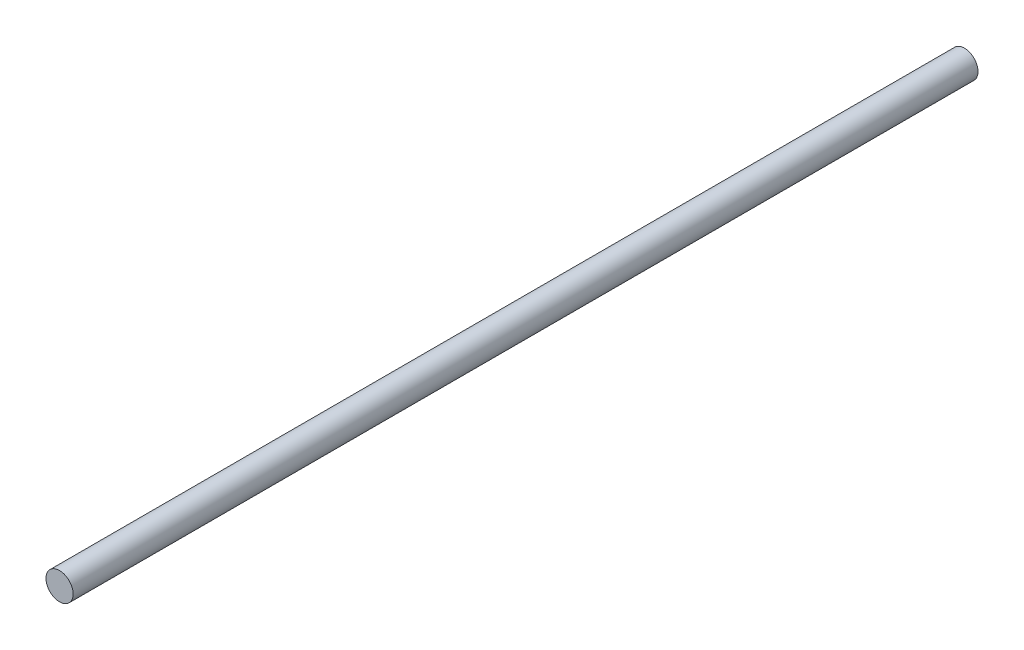
ISO-10303-21;
HEADER;
FILE_DESCRIPTION(('STEP AP214'),'2;1');
FILE_NAME('part.step','',(''),(''),'','','');
FILE_SCHEMA(('AUTOMOTIVE_DESIGN { 1 0 10303 214 1 1 1 1 }'));
ENDSEC;
DATA;
#1=APPLICATION_CONTEXT('core data for automotive mechanical design processes');
#2=APPLICATION_PROTOCOL_DEFINITION('international standard','automotive_design',2000,#1);
#3=PRODUCT_CONTEXT('',#1,'mechanical');
#4=PRODUCT('Part','Part','',(#3));
#5=PRODUCT_RELATED_PRODUCT_CATEGORY('part','',(#4));
#6=PRODUCT_DEFINITION_FORMATION('','',#4);
#7=PRODUCT_DEFINITION_CONTEXT('part definition',#1,'design');
#8=PRODUCT_DEFINITION('design','',#6,#7);
#9=PRODUCT_DEFINITION_SHAPE('','',#8);
#10=(LENGTH_UNIT() NAMED_UNIT(*) SI_UNIT(.MILLI.,.METRE.));
#11=(NAMED_UNIT(*) PLANE_ANGLE_UNIT() SI_UNIT($,.RADIAN.));
#12=(NAMED_UNIT(*) SI_UNIT($,.STERADIAN.) SOLID_ANGLE_UNIT());
#13=UNCERTAINTY_MEASURE_WITH_UNIT(LENGTH_MEASURE(1.E-05),#10,'distance_accuracy_value','');
#14=(GEOMETRIC_REPRESENTATION_CONTEXT(3) GLOBAL_UNCERTAINTY_ASSIGNED_CONTEXT((#13)) GLOBAL_UNIT_ASSIGNED_CONTEXT((#10,
#11,#12)) REPRESENTATION_CONTEXT('',''));
#15=CARTESIAN_POINT('',(0.,0.,0.));
#16=DIRECTION('',(0.,0.,1.));
#17=DIRECTION('',(1.,0.,0.));
#18=AXIS2_PLACEMENT_3D('',#15,#16,#17);
#19=CARTESIAN_POINT('',(0.,0.,200.));
#20=DIRECTION('',(0.,0.,-1.));
#21=DIRECTION('',(-1.,0.,0.));
#22=AXIS2_PLACEMENT_3D('',#19,#20,#21);
#23=CYLINDRICAL_SURFACE('',#22,3.);
#24=CARTESIAN_POINT('',(0.,0.,200.));
#25=DIRECTION('',(0.,0.,1.));
#26=DIRECTION('',(1.,0.,0.));
#27=AXIS2_PLACEMENT_3D('',#24,#25,#26);
#28=CIRCLE('',#27,3.);
#29=CARTESIAN_POINT('',(3.,0.,200.));
#30=VERTEX_POINT('',#29);
#31=EDGE_CURVE('E10',#30,#30,#28,.T.);
#32=ORIENTED_EDGE('',*,*,#31,.F.);
#33=EDGE_LOOP('',(#32));
#34=FACE_BOUND('',#33,.T.);
#35=CARTESIAN_POINT('',(0.,0.,0.));
#36=DIRECTION('',(0.,0.,1.));
#37=DIRECTION('',(1.,0.,0.));
#38=AXIS2_PLACEMENT_3D('',#35,#36,#37);
#39=CIRCLE('',#38,3.);
#40=CARTESIAN_POINT('',(3.,0.,0.));
#41=VERTEX_POINT('',#40);
#42=EDGE_CURVE('E36',#41,#41,#39,.T.);
#43=ORIENTED_EDGE('',*,*,#42,.T.);
#44=EDGE_LOOP('',(#43));
#45=FACE_BOUND('',#44,.T.);
#46=ADVANCED_FACE('F33',(#34,#45),#23,.T.);
#47=CARTESIAN_POINT('',(0.,0.,200.));
#48=DIRECTION('',(0.,0.,1.));
#49=DIRECTION('',(1.,0.,0.));
#50=AXIS2_PLACEMENT_3D('',#47,#48,#49);
#51=PLANE('',#50);
#52=ORIENTED_EDGE('',*,*,#31,.T.);
#53=EDGE_LOOP('',(#52));
#54=FACE_BOUND('',#53,.T.);
#55=ADVANCED_FACE('F48',(#54),#51,.T.);
#56=CARTESIAN_POINT('',(0.,0.,0.));
#57=DIRECTION('',(0.,0.,1.));
#58=DIRECTION('',(1.,0.,0.));
#59=AXIS2_PLACEMENT_3D('',#56,#57,#58);
#60=PLANE('',#59);
#61=ORIENTED_EDGE('',*,*,#42,.F.);
#62=EDGE_LOOP('',(#61));
#63=FACE_BOUND('',#62,.T.);
#64=ADVANCED_FACE('F46',(#63),#60,.F.);
#65=CLOSED_SHELL('',(#46,#55,#64));
#66=MANIFOLD_SOLID_BREP('B2',#65);
#67=ADVANCED_BREP_SHAPE_REPRESENTATION('',(#18,#66),#14);
#68=SHAPE_DEFINITION_REPRESENTATION(#9,#67);
ENDSEC;
END-ISO-10303-21;
